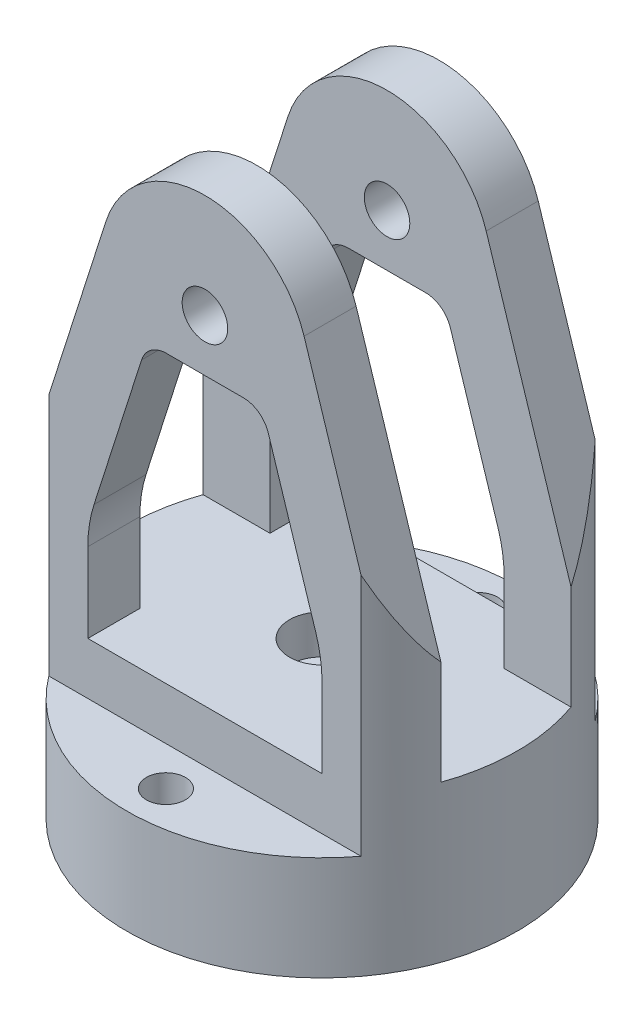
ISO-10303-21;
HEADER;
FILE_DESCRIPTION(('STEP AP214'),'2;1');
FILE_NAME('part.step','',(''),(''),'','','');
FILE_SCHEMA(('AUTOMOTIVE_DESIGN { 1 0 10303 214 1 1 1 1 }'));
ENDSEC;
DATA;
#1=APPLICATION_CONTEXT('core data for automotive mechanical design processes');
#2=APPLICATION_PROTOCOL_DEFINITION('international standard','automotive_design',2000,#1);
#3=PRODUCT_CONTEXT('',#1,'mechanical');
#4=PRODUCT('Part','Part','',(#3));
#5=PRODUCT_RELATED_PRODUCT_CATEGORY('part','',(#4));
#6=PRODUCT_DEFINITION_FORMATION('','',#4);
#7=PRODUCT_DEFINITION_CONTEXT('part definition',#1,'design');
#8=PRODUCT_DEFINITION('design','',#6,#7);
#9=PRODUCT_DEFINITION_SHAPE('','',#8);
#10=(LENGTH_UNIT() NAMED_UNIT(*) SI_UNIT(.MILLI.,.METRE.));
#11=(NAMED_UNIT(*) PLANE_ANGLE_UNIT() SI_UNIT($,.RADIAN.));
#12=(NAMED_UNIT(*) SI_UNIT($,.STERADIAN.) SOLID_ANGLE_UNIT());
#13=UNCERTAINTY_MEASURE_WITH_UNIT(LENGTH_MEASURE(1.E-05),#10,'distance_accuracy_value','');
#14=(GEOMETRIC_REPRESENTATION_CONTEXT(3) GLOBAL_UNCERTAINTY_ASSIGNED_CONTEXT((#13)) GLOBAL_UNIT_ASSIGNED_CONTEXT((#10,
#11,#12)) REPRESENTATION_CONTEXT('',''));
#15=CARTESIAN_POINT('',(0.,0.,0.));
#16=DIRECTION('',(0.,0.,1.));
#17=DIRECTION('',(1.,0.,0.));
#18=AXIS2_PLACEMENT_3D('',#15,#16,#17);
#19=CARTESIAN_POINT('',(0.,-100.402315710346,15.875));
#20=DIRECTION('',(0.,0.,1.));
#21=DIRECTION('',(1.,0.,0.));
#22=AXIS2_PLACEMENT_3D('',#19,#20,#21);
#23=PLANE('',#22);
#24=CARTESIAN_POINT('',(0.,120.65,15.875));
#25=DIRECTION('',(0.,0.,1.));
#26=DIRECTION('',(1.,0.,0.));
#27=AXIS2_PLACEMENT_3D('',#24,#25,#26);
#28=CIRCLE('',#27,5.55625);
#29=CARTESIAN_POINT('',(5.55625,120.65,15.875));
#30=VERTEX_POINT('',#29);
#31=EDGE_CURVE('E710',#30,#30,#28,.T.);
#32=ORIENTED_EDGE('',*,*,#31,.T.);
#33=EDGE_LOOP('',(#32));
#34=FACE_BOUND('',#33,.T.);
#35=DIRECTION('',(0.30403629343905,0.952660449620873,0.));
#36=VECTOR('',#35,1.);
#37=CARTESIAN_POINT('',(-88.2239091120022,-72.2461449258955,15.875));
#38=LINE('',#37,#36);
#39=CARTESIAN_POINT('',(-44.9012806053458,63.5,15.875));
#40=VERTEX_POINT('',#39);
#41=CARTESIAN_POINT('',(-24.1975754203702,128.372521853352,15.875));
#42=VERTEX_POINT('',#41);
#43=EDGE_CURVE('E717',#40,#42,#38,.T.);
#44=ORIENTED_EDGE('',*,*,#43,.T.);
#45=CARTESIAN_POINT('',(0.,120.65,15.875));
#46=DIRECTION('',(0.,0.,1.));
#47=DIRECTION('',(1.,0.,0.));
#48=AXIS2_PLACEMENT_3D('',#45,#46,#47);
#49=CIRCLE('',#48,25.4);
#50=CARTESIAN_POINT('',(24.1975754203702,128.372521853352,15.875));
#51=VERTEX_POINT('',#50);
#52=EDGE_CURVE('E708',#51,#42,#49,.T.);
#53=ORIENTED_EDGE('',*,*,#52,.F.);
#54=DIRECTION('',(-0.30403629343905,0.952660449620873,0.));
#55=VECTOR('',#54,1.);
#56=CARTESIAN_POINT('',(88.2239091120022,-72.2461449258955,15.875));
#57=LINE('',#56,#55);
#58=CARTESIAN_POINT('',(44.9012806053458,63.5,15.875));
#59=VERTEX_POINT('',#58);
#60=EDGE_CURVE('E725',#59,#51,#57,.T.);
#61=ORIENTED_EDGE('',*,*,#60,.F.);
#62=DIRECTION('',(0.,1.,0.));
#63=VECTOR('',#62,1.);
#64=CARTESIAN_POINT('',(44.9012806053458,-100.402315710346,15.875));
#65=LINE('',#64,#63);
#66=CARTESIAN_POINT('',(44.9012806053458,38.1,15.875));
#67=VERTEX_POINT('',#66);
#68=EDGE_CURVE('E632',#67,#59,#65,.T.);
#69=ORIENTED_EDGE('',*,*,#68,.F.);
#70=DIRECTION('',(1.,0.,0.));
#71=VECTOR('',#70,1.);
#72=CARTESIAN_POINT('',(0.,38.1,15.875));
#73=LINE('',#72,#71);
#74=CARTESIAN_POINT('',(28.575,38.1,15.875));
#75=VERTEX_POINT('',#74);
#76=EDGE_CURVE('E851',#75,#67,#73,.T.);
#77=ORIENTED_EDGE('',*,*,#76,.F.);
#78=DIRECTION('',(0.,1.,0.));
#79=VECTOR('',#78,1.);
#80=CARTESIAN_POINT('',(28.575,-100.402315710346,15.875));
#81=LINE('',#80,#79);
#82=CARTESIAN_POINT('',(28.575,57.4986477213851,15.875));
#83=VERTEX_POINT('',#82);
#84=EDGE_CURVE('E780',#75,#83,#81,.T.);
#85=ORIENTED_EDGE('',*,*,#84,.T.);
#86=CARTESIAN_POINT('',(-3.17499999999999,57.4986477213852,15.875));
#87=DIRECTION('',(0.,0.,1.));
#88=DIRECTION('',(1.,0.,0.));
#89=AXIS2_PLACEMENT_3D('',#86,#87,#88);
#90=CIRCLE('',#89,31.75);
#91=CARTESIAN_POINT('',(27.0719692754627,67.1518000380751,15.875));
#92=VERTEX_POINT('',#91);
#93=EDGE_CURVE('E788',#92,#83,#90,.F.);
#94=ORIENTED_EDGE('',*,*,#93,.F.);
#95=DIRECTION('',(-0.30403629343905,0.952660449620873,0.));
#96=VECTOR('',#95,1.);
#97=CARTESIAN_POINT('',(73.1004244742708,-77.0727210842404,15.875));
#98=LINE('',#97,#96);
#99=CARTESIAN_POINT('',(15.4618675161776,103.530630463338,15.875));
#100=VERTEX_POINT('',#99);
#101=EDGE_CURVE('E797',#92,#100,#98,.T.);
#102=ORIENTED_EDGE('',*,*,#101,.T.);
#103=CARTESIAN_POINT('',(9.41247366108504,101.6,15.875));
#104=DIRECTION('',(0.,0.,1.));
#105=DIRECTION('',(1.,0.,0.));
#106=AXIS2_PLACEMENT_3D('',#103,#104,#105);
#107=CIRCLE('',#106,6.35);
#108=CARTESIAN_POINT('',(9.41247366108501,107.95,15.875));
#109=VERTEX_POINT('',#108);
#110=EDGE_CURVE('E805',#100,#109,#107,.T.);
#111=ORIENTED_EDGE('',*,*,#110,.T.);
#112=DIRECTION('',(1.,0.,0.));
#113=VECTOR('',#112,1.);
#114=CARTESIAN_POINT('',(3.07195465380101E-13,107.95,15.875));
#115=LINE('',#114,#113);
#116=CARTESIAN_POINT('',(-9.41247366108502,107.95,15.875));
#117=VERTEX_POINT('',#116);
#118=EDGE_CURVE('E813',#117,#109,#115,.T.);
#119=ORIENTED_EDGE('',*,*,#118,.F.);
#120=CARTESIAN_POINT('',(-9.41247366108505,101.6,15.875));
#121=DIRECTION('',(0.,0.,1.));
#122=DIRECTION('',(1.,0.,0.));
#123=AXIS2_PLACEMENT_3D('',#120,#121,#122);
#124=CIRCLE('',#123,6.35);
#125=CARTESIAN_POINT('',(-15.4618675161776,103.530630463338,15.875));
#126=VERTEX_POINT('',#125);
#127=EDGE_CURVE('E820',#126,#117,#124,.F.);
#128=ORIENTED_EDGE('',*,*,#127,.F.);
#129=DIRECTION('',(0.30403629343905,0.952660449620873,0.));
#130=VECTOR('',#129,1.);
#131=CARTESIAN_POINT('',(-73.1004244742709,-77.0727210842404,15.875));
#132=LINE('',#131,#130);
#133=CARTESIAN_POINT('',(-27.0719692754627,67.1518000380752,15.875));
#134=VERTEX_POINT('',#133);
#135=EDGE_CURVE('E827',#134,#126,#132,.T.);
#136=ORIENTED_EDGE('',*,*,#135,.F.);
#137=CARTESIAN_POINT('',(3.17499999999999,57.4986477213852,15.875));
#138=DIRECTION('',(0.,0.,1.));
#139=DIRECTION('',(1.,0.,0.));
#140=AXIS2_PLACEMENT_3D('',#137,#138,#139);
#141=CIRCLE('',#140,31.75);
#142=CARTESIAN_POINT('',(-28.575,57.4986477213851,15.875));
#143=VERTEX_POINT('',#142);
#144=EDGE_CURVE('E834',#134,#143,#141,.T.);
#145=ORIENTED_EDGE('',*,*,#144,.T.);
#146=DIRECTION('',(0.,1.,0.));
#147=VECTOR('',#146,1.);
#148=CARTESIAN_POINT('',(-28.575,-100.402315710346,15.875));
#149=LINE('',#148,#147);
#150=CARTESIAN_POINT('',(-28.575,38.1,15.875));
#151=VERTEX_POINT('',#150);
#152=EDGE_CURVE('E842',#151,#143,#149,.T.);
#153=ORIENTED_EDGE('',*,*,#152,.F.);
#154=CARTESIAN_POINT('',(-44.9012806053458,38.1,15.875));
#155=VERTEX_POINT('',#154);
#156=EDGE_CURVE('E635',#155,#151,#73,.T.);
#157=ORIENTED_EDGE('',*,*,#156,.F.);
#158=DIRECTION('',(0.,1.,0.));
#159=VECTOR('',#158,1.);
#160=CARTESIAN_POINT('',(-44.9012806053458,-100.402315710346,15.875));
#161=LINE('',#160,#159);
#162=EDGE_CURVE('E624',#155,#40,#161,.T.);
#163=ORIENTED_EDGE('',*,*,#162,.T.);
#164=EDGE_LOOP('',(#44,#53,#61,#69,#77,#85,#94,#102,#111,#119,#128,#136,#145,#153,#157,#163));
#165=FACE_BOUND('',#164,.T.);
#166=ADVANCED_FACE('F383',(#34,#165),#23,.F.);
#167=CARTESIAN_POINT('',(0.,-100.402315710346,-15.875));
#168=DIRECTION('',(0.,0.,1.));
#169=DIRECTION('',(1.,0.,0.));
#170=AXIS2_PLACEMENT_3D('',#167,#168,#169);
#171=PLANE('',#170);
#172=CARTESIAN_POINT('',(0.,120.65,-15.875));
#173=DIRECTION('',(0.,0.,1.));
#174=DIRECTION('',(1.,0.,0.));
#175=AXIS2_PLACEMENT_3D('',#172,#173,#174);
#176=CIRCLE('',#175,5.55625);
#177=CARTESIAN_POINT('',(5.55625,120.65,-15.875));
#178=VERTEX_POINT('',#177);
#179=EDGE_CURVE('E713',#178,#178,#176,.T.);
#180=ORIENTED_EDGE('',*,*,#179,.F.);
#181=EDGE_LOOP('',(#180));
#182=FACE_BOUND('',#181,.T.);
#183=CARTESIAN_POINT('',(0.,120.65,-15.875));
#184=DIRECTION('',(0.,0.,1.));
#185=DIRECTION('',(1.,0.,0.));
#186=AXIS2_PLACEMENT_3D('',#183,#184,#185);
#187=CIRCLE('',#186,25.4);
#188=CARTESIAN_POINT('',(24.1975754203702,128.372521853352,-15.875));
#189=VERTEX_POINT('',#188);
#190=CARTESIAN_POINT('',(-24.1975754203702,128.372521853352,-15.875));
#191=VERTEX_POINT('',#190);
#192=EDGE_CURVE('E613',#189,#191,#187,.T.);
#193=ORIENTED_EDGE('',*,*,#192,.T.);
#194=DIRECTION('',(0.30403629343905,0.952660449620873,0.));
#195=VECTOR('',#194,1.);
#196=CARTESIAN_POINT('',(-88.2239091120022,-72.2461449258955,-15.875));
#197=LINE('',#196,#195);
#198=CARTESIAN_POINT('',(-44.9012806053458,63.5,-15.875));
#199=VERTEX_POINT('',#198);
#200=EDGE_CURVE('E597',#199,#191,#197,.T.);
#201=ORIENTED_EDGE('',*,*,#200,.F.);
#202=DIRECTION('',(0.,1.,0.));
#203=VECTOR('',#202,1.);
#204=CARTESIAN_POINT('',(-44.9012806053458,-100.402315710346,-15.875));
#205=LINE('',#204,#203);
#206=CARTESIAN_POINT('',(-44.9012806053458,38.1,-15.875));
#207=VERTEX_POINT('',#206);
#208=EDGE_CURVE('E610',#207,#199,#205,.T.);
#209=ORIENTED_EDGE('',*,*,#208,.F.);
#210=DIRECTION('',(1.,0.,0.));
#211=VECTOR('',#210,1.);
#212=CARTESIAN_POINT('',(0.,38.1,-15.875));
#213=LINE('',#212,#211);
#214=CARTESIAN_POINT('',(-28.575,38.1,-15.875));
#215=VERTEX_POINT('',#214);
#216=EDGE_CURVE('E852',#207,#215,#213,.T.);
#217=ORIENTED_EDGE('',*,*,#216,.T.);
#218=DIRECTION('',(0.,1.,0.));
#219=VECTOR('',#218,1.);
#220=CARTESIAN_POINT('',(-28.575,-100.402315710346,-15.875));
#221=LINE('',#220,#219);
#222=CARTESIAN_POINT('',(-28.575,57.4986477213851,-15.875));
#223=VERTEX_POINT('',#222);
#224=EDGE_CURVE('E689',#215,#223,#221,.T.);
#225=ORIENTED_EDGE('',*,*,#224,.T.);
#226=CARTESIAN_POINT('',(3.17499999999999,57.4986477213852,-15.875));
#227=DIRECTION('',(0.,0.,1.));
#228=DIRECTION('',(1.,0.,0.));
#229=AXIS2_PLACEMENT_3D('',#226,#227,#228);
#230=CIRCLE('',#229,31.75);
#231=CARTESIAN_POINT('',(-27.0719692754627,67.1518000380752,-15.875));
#232=VERTEX_POINT('',#231);
#233=EDGE_CURVE('E687',#232,#223,#230,.T.);
#234=ORIENTED_EDGE('',*,*,#233,.F.);
#235=DIRECTION('',(0.30403629343905,0.952660449620873,0.));
#236=VECTOR('',#235,1.);
#237=CARTESIAN_POINT('',(-73.1004244742709,-77.0727210842404,-15.875));
#238=LINE('',#237,#236);
#239=CARTESIAN_POINT('',(-15.4618675161776,103.530630463338,-15.875));
#240=VERTEX_POINT('',#239);
#241=EDGE_CURVE('E684',#232,#240,#238,.T.);
#242=ORIENTED_EDGE('',*,*,#241,.T.);
#243=CARTESIAN_POINT('',(-9.41247366108505,101.6,-15.875));
#244=DIRECTION('',(0.,0.,1.));
#245=DIRECTION('',(1.,0.,0.));
#246=AXIS2_PLACEMENT_3D('',#243,#244,#245);
#247=CIRCLE('',#246,6.35);
#248=CARTESIAN_POINT('',(-9.41247366108502,107.95,-15.875));
#249=VERTEX_POINT('',#248);
#250=EDGE_CURVE('E681',#240,#249,#247,.F.);
#251=ORIENTED_EDGE('',*,*,#250,.T.);
#252=DIRECTION('',(1.,0.,0.));
#253=VECTOR('',#252,1.);
#254=CARTESIAN_POINT('',(3.07195465380101E-13,107.95,-15.875));
#255=LINE('',#254,#253);
#256=CARTESIAN_POINT('',(9.41247366108501,107.95,-15.875));
#257=VERTEX_POINT('',#256);
#258=EDGE_CURVE('E678',#249,#257,#255,.T.);
#259=ORIENTED_EDGE('',*,*,#258,.T.);
#260=CARTESIAN_POINT('',(9.41247366108504,101.6,-15.875));
#261=DIRECTION('',(0.,0.,1.));
#262=DIRECTION('',(1.,0.,0.));
#263=AXIS2_PLACEMENT_3D('',#260,#261,#262);
#264=CIRCLE('',#263,6.35);
#265=CARTESIAN_POINT('',(15.4618675161776,103.530630463338,-15.875));
#266=VERTEX_POINT('',#265);
#267=EDGE_CURVE('E676',#266,#257,#264,.T.);
#268=ORIENTED_EDGE('',*,*,#267,.F.);
#269=DIRECTION('',(-0.30403629343905,0.952660449620873,0.));
#270=VECTOR('',#269,1.);
#271=CARTESIAN_POINT('',(73.1004244742708,-77.0727210842404,-15.875));
#272=LINE('',#271,#270);
#273=CARTESIAN_POINT('',(27.0719692754627,67.1518000380751,-15.875));
#274=VERTEX_POINT('',#273);
#275=EDGE_CURVE('E674',#274,#266,#272,.T.);
#276=ORIENTED_EDGE('',*,*,#275,.F.);
#277=CARTESIAN_POINT('',(-3.17499999999999,57.4986477213852,-15.875));
#278=DIRECTION('',(0.,0.,1.));
#279=DIRECTION('',(1.,0.,0.));
#280=AXIS2_PLACEMENT_3D('',#277,#278,#279);
#281=CIRCLE('',#280,31.75);
#282=CARTESIAN_POINT('',(28.575,57.4986477213851,-15.875));
#283=VERTEX_POINT('',#282);
#284=EDGE_CURVE('E671',#274,#283,#281,.F.);
#285=ORIENTED_EDGE('',*,*,#284,.T.);
#286=DIRECTION('',(0.,1.,0.));
#287=VECTOR('',#286,1.);
#288=CARTESIAN_POINT('',(28.575,-100.402315710346,-15.875));
#289=LINE('',#288,#287);
#290=CARTESIAN_POINT('',(28.575,38.1,-15.875));
#291=VERTEX_POINT('',#290);
#292=EDGE_CURVE('E669',#291,#283,#289,.T.);
#293=ORIENTED_EDGE('',*,*,#292,.F.);
#294=CARTESIAN_POINT('',(44.9012806053458,38.1,-15.875));
#295=VERTEX_POINT('',#294);
#296=EDGE_CURVE('E849',#291,#295,#213,.T.);
#297=ORIENTED_EDGE('',*,*,#296,.T.);
#298=DIRECTION('',(0.,1.,0.));
#299=VECTOR('',#298,1.);
#300=CARTESIAN_POINT('',(44.9012806053458,-100.402315710346,-15.875));
#301=LINE('',#300,#299);
#302=CARTESIAN_POINT('',(44.9012806053458,63.5,-15.875));
#303=VERTEX_POINT('',#302);
#304=EDGE_CURVE('E622',#295,#303,#301,.T.);
#305=ORIENTED_EDGE('',*,*,#304,.T.);
#306=DIRECTION('',(-0.30403629343905,0.952660449620873,0.));
#307=VECTOR('',#306,1.);
#308=CARTESIAN_POINT('',(88.2239091120022,-72.2461449258955,-15.875));
#309=LINE('',#308,#307);
#310=EDGE_CURVE('E729',#303,#189,#309,.T.);
#311=ORIENTED_EDGE('',*,*,#310,.T.);
#312=EDGE_LOOP('',(#193,#201,#209,#217,#225,#234,#242,#251,#259,#268,#276,#285,#293,#297,#305,#311));
#313=FACE_BOUND('',#312,.T.);
#314=ADVANCED_FACE('F608',(#182,#313),#171,.T.);
#315=CARTESIAN_POINT('',(0.,-78.5451621680164,-28.575));
#316=DIRECTION('',(0.,0.,1.));
#317=DIRECTION('',(1.,0.,0.));
#318=AXIS2_PLACEMENT_3D('',#315,#316,#317);
#319=PLANE('',#318);
#320=CARTESIAN_POINT('',(0.,120.65,-28.575));
#321=DIRECTION('',(0.,0.,1.));
#322=DIRECTION('',(1.,0.,0.));
#323=AXIS2_PLACEMENT_3D('',#320,#321,#322);
#324=CIRCLE('',#323,5.55625);
#325=CARTESIAN_POINT('',(5.55625,120.65,-28.575));
#326=VERTEX_POINT('',#325);
#327=EDGE_CURVE('E942',#326,#326,#324,.T.);
#328=ORIENTED_EDGE('',*,*,#327,.T.);
#329=EDGE_LOOP('',(#328));
#330=FACE_BOUND('',#329,.T.);
#331=DIRECTION('',(0.,1.,0.));
#332=VECTOR('',#331,1.);
#333=CARTESIAN_POINT('',(-28.575,-78.5451621680164,-28.575));
#334=LINE('',#333,#332);
#335=CARTESIAN_POINT('',(-28.575,38.1,-28.575));
#336=VERTEX_POINT('',#335);
#337=CARTESIAN_POINT('',(-28.575,57.4986477213851,-28.575));
#338=VERTEX_POINT('',#337);
#339=EDGE_CURVE('E847',#336,#338,#334,.T.);
#340=ORIENTED_EDGE('',*,*,#339,.F.);
#341=DIRECTION('',(1.,0.,0.));
#342=VECTOR('',#341,1.);
#343=CARTESIAN_POINT('',(0.,38.1,-28.575));
#344=LINE('',#343,#342);
#345=CARTESIAN_POINT('',(28.575,38.1,-28.575));
#346=VERTEX_POINT('',#345);
#347=EDGE_CURVE('E777',#336,#346,#344,.T.);
#348=ORIENTED_EDGE('',*,*,#347,.T.);
#349=DIRECTION('',(0.,1.,0.));
#350=VECTOR('',#349,1.);
#351=CARTESIAN_POINT('',(28.575,-78.5451621680164,-28.575));
#352=LINE('',#351,#350);
#353=CARTESIAN_POINT('',(28.575,57.4986477213851,-28.575));
#354=VERTEX_POINT('',#353);
#355=EDGE_CURVE('E785',#346,#354,#352,.T.);
#356=ORIENTED_EDGE('',*,*,#355,.T.);
#357=CARTESIAN_POINT('',(-3.17499999999999,57.4986477213852,-28.575));
#358=DIRECTION('',(0.,0.,1.));
#359=DIRECTION('',(1.,0.,0.));
#360=AXIS2_PLACEMENT_3D('',#357,#358,#359);
#361=CIRCLE('',#360,31.75);
#362=CARTESIAN_POINT('',(27.0719692754627,67.1518000380751,-28.575));
#363=VERTEX_POINT('',#362);
#364=EDGE_CURVE('E794',#363,#354,#361,.F.);
#365=ORIENTED_EDGE('',*,*,#364,.F.);
#366=DIRECTION('',(-0.30403629343905,0.952660449620873,0.));
#367=VECTOR('',#366,1.);
#368=CARTESIAN_POINT('',(66.7696452569015,-57.2360005814013,-28.575));
#369=LINE('',#368,#367);
#370=CARTESIAN_POINT('',(15.4618675161776,103.530630463338,-28.575));
#371=VERTEX_POINT('',#370);
#372=EDGE_CURVE('E802',#363,#371,#369,.T.);
#373=ORIENTED_EDGE('',*,*,#372,.T.);
#374=CARTESIAN_POINT('',(9.41247366108504,101.6,-28.575));
#375=DIRECTION('',(0.,0.,1.));
#376=DIRECTION('',(1.,0.,0.));
#377=AXIS2_PLACEMENT_3D('',#374,#375,#376);
#378=CIRCLE('',#377,6.35);
#379=CARTESIAN_POINT('',(9.41247366108501,107.95,-28.575));
#380=VERTEX_POINT('',#379);
#381=EDGE_CURVE('E810',#371,#380,#378,.T.);
#382=ORIENTED_EDGE('',*,*,#381,.T.);
#383=DIRECTION('',(1.,0.,0.));
#384=VECTOR('',#383,1.);
#385=CARTESIAN_POINT('',(2.74969193109363E-13,107.95,-28.575));
#386=LINE('',#385,#384);
#387=CARTESIAN_POINT('',(-9.41247366108502,107.95,-28.575));
#388=VERTEX_POINT('',#387);
#389=EDGE_CURVE('E818',#388,#380,#386,.T.);
#390=ORIENTED_EDGE('',*,*,#389,.F.);
#391=CARTESIAN_POINT('',(-9.41247366108505,101.6,-28.575));
#392=DIRECTION('',(0.,0.,1.));
#393=DIRECTION('',(1.,0.,0.));
#394=AXIS2_PLACEMENT_3D('',#391,#392,#393);
#395=CIRCLE('',#394,6.35);
#396=CARTESIAN_POINT('',(-15.4618675161776,103.530630463338,-28.575));
#397=VERTEX_POINT('',#396);
#398=EDGE_CURVE('E825',#397,#388,#395,.F.);
#399=ORIENTED_EDGE('',*,*,#398,.F.);
#400=DIRECTION('',(0.30403629343905,0.952660449620873,0.));
#401=VECTOR('',#400,1.);
#402=CARTESIAN_POINT('',(-66.7696452569015,-57.2360005814013,-28.575));
#403=LINE('',#402,#401);
#404=CARTESIAN_POINT('',(-27.0719692754627,67.1518000380752,-28.575));
#405=VERTEX_POINT('',#404);
#406=EDGE_CURVE('E832',#405,#397,#403,.T.);
#407=ORIENTED_EDGE('',*,*,#406,.F.);
#408=CARTESIAN_POINT('',(3.17499999999999,57.4986477213852,-28.575));
#409=DIRECTION('',(0.,0.,1.));
#410=DIRECTION('',(1.,0.,0.));
#411=AXIS2_PLACEMENT_3D('',#408,#409,#410);
#412=CIRCLE('',#411,31.75);
#413=EDGE_CURVE('E839',#405,#338,#412,.T.);
#414=ORIENTED_EDGE('',*,*,#413,.T.);
#415=EDGE_LOOP('',(#340,#348,#356,#365,#373,#382,#390,#399,#407,#414));
#416=FACE_BOUND('',#415,.T.);
#417=DIRECTION('',(0.30403629343905,0.952660449620873,0.));
#418=VECTOR('',#417,1.);
#419=CARTESIAN_POINT('',(-81.8931298946328,-52.4094244230565,-28.575));
#420=LINE('',#419,#418);
#421=CARTESIAN_POINT('',(-38.1,84.8109789170132,-28.575));
#422=VERTEX_POINT('',#421);
#423=CARTESIAN_POINT('',(-24.1975754203702,128.372521853352,-28.575));
#424=VERTEX_POINT('',#423);
#425=EDGE_CURVE('E600',#422,#424,#420,.T.);
#426=ORIENTED_EDGE('',*,*,#425,.T.);
#427=CARTESIAN_POINT('',(0.,120.65,-28.575));
#428=DIRECTION('',(0.,0.,1.));
#429=DIRECTION('',(1.,0.,0.));
#430=AXIS2_PLACEMENT_3D('',#427,#428,#429);
#431=CIRCLE('',#430,25.4);
#432=CARTESIAN_POINT('',(24.1975754203702,128.372521853352,-28.575));
#433=VERTEX_POINT('',#432);
#434=EDGE_CURVE('E731',#433,#424,#431,.T.);
#435=ORIENTED_EDGE('',*,*,#434,.F.);
#436=DIRECTION('',(-0.30403629343905,0.952660449620873,0.));
#437=VECTOR('',#436,1.);
#438=CARTESIAN_POINT('',(81.8931298946328,-52.4094244230565,-28.575));
#439=LINE('',#438,#437);
#440=CARTESIAN_POINT('',(38.1,84.8109789170131,-28.575));
#441=VERTEX_POINT('',#440);
#442=EDGE_CURVE('E727',#441,#433,#439,.T.);
#443=ORIENTED_EDGE('',*,*,#442,.F.);
#444=DIRECTION('',(0.,1.,0.));
#445=VECTOR('',#444,1.);
#446=CARTESIAN_POINT('',(38.1,-78.5451621680164,-28.575));
#447=LINE('',#446,#445);
#448=CARTESIAN_POINT('',(38.1,25.4,-28.575));
#449=VERTEX_POINT('',#448);
#450=EDGE_CURVE('E655',#449,#441,#447,.T.);
#451=ORIENTED_EDGE('',*,*,#450,.F.);
#452=DIRECTION('',(1.,0.,0.));
#453=VECTOR('',#452,1.);
#454=CARTESIAN_POINT('',(0.,25.4,-28.575));
#455=LINE('',#454,#453);
#456=CARTESIAN_POINT('',(-38.1,25.4,-28.575));
#457=VERTEX_POINT('',#456);
#458=EDGE_CURVE('E652',#457,#449,#455,.T.);
#459=ORIENTED_EDGE('',*,*,#458,.F.);
#460=DIRECTION('',(0.,1.,0.));
#461=VECTOR('',#460,1.);
#462=CARTESIAN_POINT('',(-38.1,-78.5451621680164,-28.575));
#463=LINE('',#462,#461);
#464=EDGE_CURVE('E659',#457,#422,#463,.T.);
#465=ORIENTED_EDGE('',*,*,#464,.T.);
#466=EDGE_LOOP('',(#426,#435,#443,#451,#459,#465));
#467=FACE_BOUND('',#466,.T.);
#468=ADVANCED_FACE('F867',(#330,#416,#467),#319,.F.);
#469=CARTESIAN_POINT('',(0.,-78.5451621680164,28.575));
#470=DIRECTION('',(0.,0.,1.));
#471=DIRECTION('',(1.,0.,0.));
#472=AXIS2_PLACEMENT_3D('',#469,#470,#471);
#473=PLANE('',#472);
#474=CARTESIAN_POINT('',(0.,120.65,28.575));
#475=DIRECTION('',(0.,0.,1.));
#476=DIRECTION('',(1.,0.,0.));
#477=AXIS2_PLACEMENT_3D('',#474,#475,#476);
#478=CIRCLE('',#477,5.55625);
#479=CARTESIAN_POINT('',(5.55625,120.65,28.575));
#480=VERTEX_POINT('',#479);
#481=EDGE_CURVE('E387',#480,#480,#478,.T.);
#482=ORIENTED_EDGE('',*,*,#481,.F.);
#483=EDGE_LOOP('',(#482));
#484=FACE_BOUND('',#483,.T.);
#485=DIRECTION('',(1.,0.,0.));
#486=VECTOR('',#485,1.);
#487=CARTESIAN_POINT('',(0.,38.1,28.575));
#488=LINE('',#487,#486);
#489=CARTESIAN_POINT('',(-28.575,38.1,28.575));
#490=VERTEX_POINT('',#489);
#491=CARTESIAN_POINT('',(28.575,38.1,28.575));
#492=VERTEX_POINT('',#491);
#493=EDGE_CURVE('E774',#490,#492,#488,.T.);
#494=ORIENTED_EDGE('',*,*,#493,.F.);
#495=DIRECTION('',(0.,1.,0.));
#496=VECTOR('',#495,1.);
#497=CARTESIAN_POINT('',(-28.575,-78.5451621680164,28.575));
#498=LINE('',#497,#496);
#499=CARTESIAN_POINT('',(-28.575,57.4986477213851,28.575));
#500=VERTEX_POINT('',#499);
#501=EDGE_CURVE('E844',#490,#500,#498,.T.);
#502=ORIENTED_EDGE('',*,*,#501,.T.);
#503=CARTESIAN_POINT('',(3.17499999999999,57.4986477213852,28.575));
#504=DIRECTION('',(0.,0.,1.));
#505=DIRECTION('',(1.,0.,0.));
#506=AXIS2_PLACEMENT_3D('',#503,#504,#505);
#507=CIRCLE('',#506,31.75);
#508=CARTESIAN_POINT('',(-27.0719692754627,67.1518000380752,28.575));
#509=VERTEX_POINT('',#508);
#510=EDGE_CURVE('E837',#509,#500,#507,.T.);
#511=ORIENTED_EDGE('',*,*,#510,.F.);
#512=DIRECTION('',(0.30403629343905,0.952660449620873,0.));
#513=VECTOR('',#512,1.);
#514=CARTESIAN_POINT('',(-66.7696452569015,-57.2360005814013,28.575));
#515=LINE('',#514,#513);
#516=CARTESIAN_POINT('',(-15.4618675161776,103.530630463338,28.575));
#517=VERTEX_POINT('',#516);
#518=EDGE_CURVE('E829',#509,#517,#515,.T.);
#519=ORIENTED_EDGE('',*,*,#518,.T.);
#520=CARTESIAN_POINT('',(-9.41247366108505,101.6,28.575));
#521=DIRECTION('',(0.,0.,1.));
#522=DIRECTION('',(1.,0.,0.));
#523=AXIS2_PLACEMENT_3D('',#520,#521,#522);
#524=CIRCLE('',#523,6.35);
#525=CARTESIAN_POINT('',(-9.41247366108502,107.95,28.575));
#526=VERTEX_POINT('',#525);
#527=EDGE_CURVE('E822',#517,#526,#524,.F.);
#528=ORIENTED_EDGE('',*,*,#527,.T.);
#529=DIRECTION('',(1.,0.,0.));
#530=VECTOR('',#529,1.);
#531=CARTESIAN_POINT('',(2.74969193109363E-13,107.95,28.575));
#532=LINE('',#531,#530);
#533=CARTESIAN_POINT('',(9.41247366108501,107.95,28.575));
#534=VERTEX_POINT('',#533);
#535=EDGE_CURVE('E815',#526,#534,#532,.T.);
#536=ORIENTED_EDGE('',*,*,#535,.T.);
#537=CARTESIAN_POINT('',(9.41247366108504,101.6,28.575));
#538=DIRECTION('',(0.,0.,1.));
#539=DIRECTION('',(1.,0.,0.));
#540=AXIS2_PLACEMENT_3D('',#537,#538,#539);
#541=CIRCLE('',#540,6.35);
#542=CARTESIAN_POINT('',(15.4618675161776,103.530630463338,28.575));
#543=VERTEX_POINT('',#542);
#544=EDGE_CURVE('E808',#543,#534,#541,.T.);
#545=ORIENTED_EDGE('',*,*,#544,.F.);
#546=DIRECTION('',(-0.30403629343905,0.952660449620873,0.));
#547=VECTOR('',#546,1.);
#548=CARTESIAN_POINT('',(66.7696452569015,-57.2360005814013,28.575));
#549=LINE('',#548,#547);
#550=CARTESIAN_POINT('',(27.0719692754627,67.1518000380751,28.575));
#551=VERTEX_POINT('',#550);
#552=EDGE_CURVE('E800',#551,#543,#549,.T.);
#553=ORIENTED_EDGE('',*,*,#552,.F.);
#554=CARTESIAN_POINT('',(-3.17499999999999,57.4986477213852,28.575));
#555=DIRECTION('',(0.,0.,1.));
#556=DIRECTION('',(1.,0.,0.));
#557=AXIS2_PLACEMENT_3D('',#554,#555,#556);
#558=CIRCLE('',#557,31.75);
#559=CARTESIAN_POINT('',(28.575,57.4986477213851,28.575));
#560=VERTEX_POINT('',#559);
#561=EDGE_CURVE('E791',#551,#560,#558,.F.);
#562=ORIENTED_EDGE('',*,*,#561,.T.);
#563=DIRECTION('',(0.,1.,0.));
#564=VECTOR('',#563,1.);
#565=CARTESIAN_POINT('',(28.575,-78.5451621680164,28.575));
#566=LINE('',#565,#564);
#567=EDGE_CURVE('E783',#492,#560,#566,.T.);
#568=ORIENTED_EDGE('',*,*,#567,.F.);
#569=EDGE_LOOP('',(#494,#502,#511,#519,#528,#536,#545,#553,#562,#568));
#570=FACE_BOUND('',#569,.T.);
#571=CARTESIAN_POINT('',(0.,120.65,28.575));
#572=DIRECTION('',(0.,0.,1.));
#573=DIRECTION('',(1.,0.,0.));
#574=AXIS2_PLACEMENT_3D('',#571,#572,#573);
#575=CIRCLE('',#574,25.4);
#576=CARTESIAN_POINT('',(24.1975754203702,128.372521853352,28.575));
#577=VERTEX_POINT('',#576);
#578=CARTESIAN_POINT('',(-24.1975754203702,128.372521853352,28.575));
#579=VERTEX_POINT('',#578);
#580=EDGE_CURVE('E392',#577,#579,#575,.T.);
#581=ORIENTED_EDGE('',*,*,#580,.T.);
#582=DIRECTION('',(0.30403629343905,0.952660449620873,0.));
#583=VECTOR('',#582,1.);
#584=CARTESIAN_POINT('',(-81.8931298946328,-52.4094244230565,28.575));
#585=LINE('',#584,#583);
#586=CARTESIAN_POINT('',(-38.1,84.8109789170132,28.575));
#587=VERTEX_POINT('',#586);
#588=EDGE_CURVE('E13',#587,#579,#585,.T.);
#589=ORIENTED_EDGE('',*,*,#588,.F.);
#590=DIRECTION('',(0.,1.,0.));
#591=VECTOR('',#590,1.);
#592=CARTESIAN_POINT('',(-38.1,-78.5451621680164,28.575));
#593=LINE('',#592,#591);
#594=CARTESIAN_POINT('',(-38.1,25.4,28.575));
#595=VERTEX_POINT('',#594);
#596=EDGE_CURVE('E649',#595,#587,#593,.T.);
#597=ORIENTED_EDGE('',*,*,#596,.F.);
#598=DIRECTION('',(1.,0.,0.));
#599=VECTOR('',#598,1.);
#600=CARTESIAN_POINT('',(0.,25.4,28.575));
#601=LINE('',#600,#599);
#602=CARTESIAN_POINT('',(38.1,25.4,28.575));
#603=VERTEX_POINT('',#602);
#604=EDGE_CURVE('E641',#595,#603,#601,.T.);
#605=ORIENTED_EDGE('',*,*,#604,.T.);
#606=DIRECTION('',(0.,1.,0.));
#607=VECTOR('',#606,1.);
#608=CARTESIAN_POINT('',(38.1,-78.5451621680164,28.575));
#609=LINE('',#608,#607);
#610=CARTESIAN_POINT('',(38.1,84.8109789170132,28.575));
#611=VERTEX_POINT('',#610);
#612=EDGE_CURVE('E645',#603,#611,#609,.T.);
#613=ORIENTED_EDGE('',*,*,#612,.T.);
#614=DIRECTION('',(-0.30403629343905,0.952660449620873,0.));
#615=VECTOR('',#614,1.);
#616=CARTESIAN_POINT('',(81.8931298946328,-52.4094244230565,28.575));
#617=LINE('',#616,#615);
#618=EDGE_CURVE('E692',#611,#577,#617,.T.);
#619=ORIENTED_EDGE('',*,*,#618,.T.);
#620=EDGE_LOOP('',(#581,#589,#597,#605,#613,#619));
#621=FACE_BOUND('',#620,.T.);
#622=ADVANCED_FACE('F697',(#484,#570,#621),#473,.T.);
#623=CARTESIAN_POINT('',(0.,0.,0.));
#624=DIRECTION('',(0.,-1.,0.));
#625=DIRECTION('',(0.,0.,-1.));
#626=AXIS2_PLACEMENT_3D('',#623,#624,#625);
#627=CYLINDRICAL_SURFACE('',#626,47.625);
#628=CARTESIAN_POINT('',(0.,204.192657729091,0.));
#629=DIRECTION('',(0.952660449620873,-0.30403629343905,0.));
#630=DIRECTION('',(-0.30403629343905,-0.952660449620873,0.));
#631=AXIS2_PLACEMENT_3D('',#628,#629,#630);
#632=ELLIPSE('',#631,156.642483242046,47.625);
#633=EDGE_CURVE('E606',#40,#587,#632,.F.);
#634=ORIENTED_EDGE('',*,*,#633,.F.);
#635=ORIENTED_EDGE('',*,*,#162,.F.);
#636=CARTESIAN_POINT('',(0.,38.1,0.));
#637=DIRECTION('',(0.,-1.,0.));
#638=DIRECTION('',(0.,0.,-1.));
#639=AXIS2_PLACEMENT_3D('',#636,#637,#638);
#640=CIRCLE('',#639,47.625);
#641=EDGE_CURVE('E621',#207,#155,#640,.F.);
#642=ORIENTED_EDGE('',*,*,#641,.F.);
#643=ORIENTED_EDGE('',*,*,#208,.T.);
#644=EDGE_CURVE('E593',#422,#199,#632,.F.);
#645=ORIENTED_EDGE('',*,*,#644,.F.);
#646=ORIENTED_EDGE('',*,*,#464,.F.);
#647=CARTESIAN_POINT('',(0.,25.4,0.));
#648=DIRECTION('',(0.,-1.,0.));
#649=DIRECTION('',(0.,0.,-1.));
#650=AXIS2_PLACEMENT_3D('',#647,#648,#649);
#651=CIRCLE('',#650,47.625);
#652=EDGE_CURVE('E656',#449,#457,#651,.F.);
#653=ORIENTED_EDGE('',*,*,#652,.F.);
#654=ORIENTED_EDGE('',*,*,#450,.T.);
#655=CARTESIAN_POINT('',(0.,204.192657729091,0.));
#656=DIRECTION('',(0.952660449620873,0.30403629343905,0.));
#657=DIRECTION('',(0.30403629343905,-0.952660449620873,0.));
#658=AXIS2_PLACEMENT_3D('',#655,#656,#657);
#659=ELLIPSE('',#658,156.642483242046,47.625);
#660=EDGE_CURVE('E399',#441,#303,#659,.F.);
#661=ORIENTED_EDGE('',*,*,#660,.T.);
#662=ORIENTED_EDGE('',*,*,#304,.F.);
#663=CARTESIAN_POINT('',(0.,38.1,0.));
#664=DIRECTION('',(0.,-1.,0.));
#665=DIRECTION('',(0.,0.,-1.));
#666=AXIS2_PLACEMENT_3D('',#663,#664,#665);
#667=CIRCLE('',#666,47.625);
#668=EDGE_CURVE('E627',#67,#295,#667,.F.);
#669=ORIENTED_EDGE('',*,*,#668,.F.);
#670=ORIENTED_EDGE('',*,*,#68,.T.);
#671=EDGE_CURVE('E722',#59,#611,#659,.F.);
#672=ORIENTED_EDGE('',*,*,#671,.T.);
#673=ORIENTED_EDGE('',*,*,#612,.F.);
#674=CARTESIAN_POINT('',(0.,25.4,0.));
#675=DIRECTION('',(0.,-1.,0.));
#676=DIRECTION('',(0.,0.,-1.));
#677=AXIS2_PLACEMENT_3D('',#674,#675,#676);
#678=CIRCLE('',#677,47.625);
#679=EDGE_CURVE('E642',#595,#603,#678,.F.);
#680=ORIENTED_EDGE('',*,*,#679,.F.);
#681=ORIENTED_EDGE('',*,*,#596,.T.);
#682=EDGE_LOOP('',(#634,#635,#642,#643,#645,#646,#653,#654,#661,#662,#669,#670,#672,#673,#680,#681));
#683=FACE_BOUND('',#682,.T.);
#684=CARTESIAN_POINT('',(0.,0.,0.));
#685=DIRECTION('',(0.,-1.,0.));
#686=DIRECTION('',(0.,0.,-1.));
#687=AXIS2_PLACEMENT_3D('',#684,#685,#686);
#688=CIRCLE('',#687,47.625);
#689=CARTESIAN_POINT('',(0.,0.,-47.625));
#690=VERTEX_POINT('',#689);
#691=EDGE_CURVE('E666',#690,#690,#688,.T.);
#692=ORIENTED_EDGE('',*,*,#691,.F.);
#693=EDGE_LOOP('',(#692));
#694=FACE_BOUND('',#693,.T.);
#695=ADVANCED_FACE('F617',(#683,#694),#627,.T.);
#696=CARTESIAN_POINT('',(0.,0.,0.));
#697=DIRECTION('',(0.,-1.,0.));
#698=DIRECTION('',(0.,0.,-1.));
#699=AXIS2_PLACEMENT_3D('',#696,#697,#698);
#700=PLANE('',#699);
#701=CARTESIAN_POINT('',(0.,0.,-38.1));
#702=DIRECTION('',(0.,1.,0.));
#703=DIRECTION('',(0.,0.,-1.));
#704=AXIS2_PLACEMENT_3D('',#701,#702,#703);
#705=CIRCLE('',#704,4.7625);
#706=CARTESIAN_POINT('',(0.,0.,-42.8625));
#707=VERTEX_POINT('',#706);
#708=EDGE_CURVE('E932',#707,#707,#705,.T.);
#709=ORIENTED_EDGE('',*,*,#708,.T.);
#710=EDGE_LOOP('',(#709));
#711=FACE_BOUND('',#710,.T.);
#712=CARTESIAN_POINT('',(0.,0.,38.1));
#713=DIRECTION('',(0.,1.,0.));
#714=DIRECTION('',(0.,0.,1.));
#715=AXIS2_PLACEMENT_3D('',#712,#713,#714);
#716=CIRCLE('',#715,4.7625);
#717=CARTESIAN_POINT('',(0.,0.,42.8625));
#718=VERTEX_POINT('',#717);
#719=EDGE_CURVE('E936',#718,#718,#716,.T.);
#720=ORIENTED_EDGE('',*,*,#719,.T.);
#721=EDGE_LOOP('',(#720));
#722=FACE_BOUND('',#721,.T.);
#723=ORIENTED_EDGE('',*,*,#691,.T.);
#724=EDGE_LOOP('',(#723));
#725=FACE_BOUND('',#724,.T.);
#726=ADVANCED_FACE('F385',(#711,#722,#725),#700,.T.);
#727=CARTESIAN_POINT('',(0.,25.4,0.));
#728=DIRECTION('',(0.,-1.,0.));
#729=DIRECTION('',(0.,0.,-1.));
#730=AXIS2_PLACEMENT_3D('',#727,#728,#729);
#731=PLANE('',#730);
#732=CARTESIAN_POINT('',(0.,25.4,-38.1));
#733=DIRECTION('',(0.,1.,0.));
#734=DIRECTION('',(0.,0.,-1.));
#735=AXIS2_PLACEMENT_3D('',#732,#733,#734);
#736=CIRCLE('',#735,4.7625);
#737=CARTESIAN_POINT('',(0.,25.4,-42.8625));
#738=VERTEX_POINT('',#737);
#739=EDGE_CURVE('E946',#738,#738,#736,.T.);
#740=ORIENTED_EDGE('',*,*,#739,.F.);
#741=EDGE_LOOP('',(#740));
#742=FACE_BOUND('',#741,.T.);
#743=ORIENTED_EDGE('',*,*,#652,.T.);
#744=ORIENTED_EDGE('',*,*,#458,.T.);
#745=EDGE_LOOP('',(#743,#744));
#746=FACE_BOUND('',#745,.T.);
#747=ADVANCED_FACE('F870',(#742,#746),#731,.F.);
#748=CARTESIAN_POINT('',(0.,25.4,0.));
#749=DIRECTION('',(0.,-1.,0.));
#750=DIRECTION('',(0.,0.,-1.));
#751=AXIS2_PLACEMENT_3D('',#748,#749,#750);
#752=PLANE('',#751);
#753=CARTESIAN_POINT('',(0.,25.4,38.1));
#754=DIRECTION('',(0.,1.,0.));
#755=DIRECTION('',(0.,0.,1.));
#756=AXIS2_PLACEMENT_3D('',#753,#754,#755);
#757=CIRCLE('',#756,4.7625);
#758=CARTESIAN_POINT('',(0.,25.4,42.8625));
#759=VERTEX_POINT('',#758);
#760=EDGE_CURVE('E939',#759,#759,#757,.T.);
#761=ORIENTED_EDGE('',*,*,#760,.F.);
#762=EDGE_LOOP('',(#761));
#763=FACE_BOUND('',#762,.T.);
#764=ORIENTED_EDGE('',*,*,#679,.T.);
#765=ORIENTED_EDGE('',*,*,#604,.F.);
#766=EDGE_LOOP('',(#764,#765));
#767=FACE_BOUND('',#766,.T.);
#768=ADVANCED_FACE('F902',(#763,#767),#752,.F.);
#769=CARTESIAN_POINT('',(0.,38.1,0.));
#770=DIRECTION('',(0.,-1.,0.));
#771=DIRECTION('',(0.,0.,-1.));
#772=AXIS2_PLACEMENT_3D('',#769,#770,#771);
#773=PLANE('',#772);
#774=ORIENTED_EDGE('',*,*,#296,.F.);
#775=DIRECTION('',(0.,0.,1.));
#776=VECTOR('',#775,1.);
#777=CARTESIAN_POINT('',(28.575,38.1,-47.625));
#778=LINE('',#777,#776);
#779=EDGE_CURVE('E772',#346,#291,#778,.T.);
#780=ORIENTED_EDGE('',*,*,#779,.F.);
#781=ORIENTED_EDGE('',*,*,#347,.F.);
#782=DIRECTION('',(0.,0.,1.));
#783=VECTOR('',#782,1.);
#784=CARTESIAN_POINT('',(-28.575,38.1,-47.625));
#785=LINE('',#784,#783);
#786=EDGE_CURVE('E739',#336,#215,#785,.T.);
#787=ORIENTED_EDGE('',*,*,#786,.T.);
#788=ORIENTED_EDGE('',*,*,#216,.F.);
#789=ORIENTED_EDGE('',*,*,#641,.T.);
#790=ORIENTED_EDGE('',*,*,#156,.T.);
#791=EDGE_CURVE('E736',#151,#490,#785,.T.);
#792=ORIENTED_EDGE('',*,*,#791,.T.);
#793=ORIENTED_EDGE('',*,*,#493,.T.);
#794=EDGE_CURVE('E735',#75,#492,#778,.T.);
#795=ORIENTED_EDGE('',*,*,#794,.F.);
#796=ORIENTED_EDGE('',*,*,#76,.T.);
#797=ORIENTED_EDGE('',*,*,#668,.T.);
#798=EDGE_LOOP('',(#774,#780,#781,#787,#788,#789,#790,#792,#793,#795,#796,#797));
#799=FACE_BOUND('',#798,.T.);
#800=CARTESIAN_POINT('',(0.,38.1,0.));
#801=DIRECTION('',(0.,-1.,0.));
#802=DIRECTION('',(0.,0.,-1.));
#803=AXIS2_PLACEMENT_3D('',#800,#801,#802);
#804=CIRCLE('',#803,7.9375);
#805=CARTESIAN_POINT('',(0.,38.1,-7.9375));
#806=VERTEX_POINT('',#805);
#807=EDGE_CURVE('E638',#806,#806,#804,.T.);
#808=ORIENTED_EDGE('',*,*,#807,.T.);
#809=EDGE_LOOP('',(#808));
#810=FACE_BOUND('',#809,.T.);
#811=ADVANCED_FACE('F860',(#799,#810),#773,.F.);
#812=CARTESIAN_POINT('',(0.,0.,0.));
#813=DIRECTION('',(0.,-1.,0.));
#814=DIRECTION('',(0.,0.,-1.));
#815=AXIS2_PLACEMENT_3D('',#812,#813,#814);
#816=CYLINDRICAL_SURFACE('',#815,7.9375);
#817=CARTESIAN_POINT('',(0.,28.575,0.));
#818=DIRECTION('',(0.,-1.,0.));
#819=DIRECTION('',(0.,0.,-1.));
#820=AXIS2_PLACEMENT_3D('',#817,#818,#819);
#821=CIRCLE('',#820,7.9375);
#822=CARTESIAN_POINT('',(0.,28.575,-7.9375));
#823=VERTEX_POINT('',#822);
#824=EDGE_CURVE('E663',#823,#823,#821,.T.);
#825=ORIENTED_EDGE('',*,*,#824,.T.);
#826=EDGE_LOOP('',(#825));
#827=FACE_BOUND('',#826,.T.);
#828=ORIENTED_EDGE('',*,*,#807,.F.);
#829=EDGE_LOOP('',(#828));
#830=FACE_BOUND('',#829,.T.);
#831=ADVANCED_FACE('F901',(#827,#830),#816,.F.);
#832=CARTESIAN_POINT('',(0.,28.575,-7.9375));
#833=DIRECTION('',(0.,1.,0.));
#834=DIRECTION('',(0.,0.,1.));
#835=AXIS2_PLACEMENT_3D('',#832,#833,#834);
#836=PLANE('',#835);
#837=ORIENTED_EDGE('',*,*,#824,.F.);
#838=EDGE_LOOP('',(#837));
#839=FACE_BOUND('',#838,.T.);
#840=ADVANCED_FACE('F915',(#839),#836,.T.);
#841=CARTESIAN_POINT('',(28.575,0.,-47.625));
#842=DIRECTION('',(1.,0.,0.));
#843=DIRECTION('',(0.,0.,-1.));
#844=AXIS2_PLACEMENT_3D('',#841,#842,#843);
#845=PLANE('',#844);
#846=ORIENTED_EDGE('',*,*,#779,.T.);
#847=ORIENTED_EDGE('',*,*,#292,.T.);
#848=DIRECTION('',(0.,0.,1.));
#849=VECTOR('',#848,1.);
#850=CARTESIAN_POINT('',(28.575,57.4986477213851,-47.625));
#851=LINE('',#850,#849);
#852=EDGE_CURVE('E768',#354,#283,#851,.T.);
#853=ORIENTED_EDGE('',*,*,#852,.F.);
#854=ORIENTED_EDGE('',*,*,#355,.F.);
#855=EDGE_LOOP('',(#846,#847,#853,#854));
#856=FACE_BOUND('',#855,.T.);
#857=ADVANCED_FACE('F918',(#856),#845,.F.);
#858=CARTESIAN_POINT('',(-3.17499999999999,57.4986477213852,-47.625));
#859=DIRECTION('',(0.,0.,1.));
#860=DIRECTION('',(1.,0.,0.));
#861=AXIS2_PLACEMENT_3D('',#858,#859,#860);
#862=CYLINDRICAL_SURFACE('',#861,31.75);
#863=ORIENTED_EDGE('',*,*,#364,.T.);
#864=ORIENTED_EDGE('',*,*,#852,.T.);
#865=ORIENTED_EDGE('',*,*,#284,.F.);
#866=DIRECTION('',(0.,0.,1.));
#867=VECTOR('',#866,1.);
#868=CARTESIAN_POINT('',(27.0719692754627,67.1518000380751,-47.625));
#869=LINE('',#868,#867);
#870=EDGE_CURVE('E764',#363,#274,#869,.T.);
#871=ORIENTED_EDGE('',*,*,#870,.F.);
#872=EDGE_LOOP('',(#863,#864,#865,#871));
#873=FACE_BOUND('',#872,.T.);
#874=ADVANCED_FACE('F979',(#873),#862,.F.);
#875=CARTESIAN_POINT('',(44.0195612024895,14.048598566409,-47.625));
#876=DIRECTION('',(0.952660449620873,0.30403629343905,0.));
#877=DIRECTION('',(-0.30403629343905,0.952660449620873,0.));
#878=AXIS2_PLACEMENT_3D('',#875,#876,#877);
#879=PLANE('',#878);
#880=ORIENTED_EDGE('',*,*,#870,.T.);
#881=ORIENTED_EDGE('',*,*,#275,.T.);
#882=DIRECTION('',(0.,0.,1.));
#883=VECTOR('',#882,1.);
#884=CARTESIAN_POINT('',(15.4618675161776,103.530630463338,-47.625));
#885=LINE('',#884,#883);
#886=EDGE_CURVE('E760',#371,#266,#885,.T.);
#887=ORIENTED_EDGE('',*,*,#886,.F.);
#888=ORIENTED_EDGE('',*,*,#372,.F.);
#889=EDGE_LOOP('',(#880,#881,#887,#888));
#890=FACE_BOUND('',#889,.T.);
#891=ADVANCED_FACE('F983',(#890),#879,.F.);
#892=CARTESIAN_POINT('',(9.41247366108504,101.6,-47.625));
#893=DIRECTION('',(0.,0.,1.));
#894=DIRECTION('',(1.,0.,0.));
#895=AXIS2_PLACEMENT_3D('',#892,#893,#894);
#896=CYLINDRICAL_SURFACE('',#895,6.35);
#897=ORIENTED_EDGE('',*,*,#886,.T.);
#898=ORIENTED_EDGE('',*,*,#267,.T.);
#899=DIRECTION('',(0.,0.,1.));
#900=VECTOR('',#899,1.);
#901=CARTESIAN_POINT('',(9.41247366108501,107.95,-47.625));
#902=LINE('',#901,#900);
#903=EDGE_CURVE('E756',#380,#257,#902,.T.);
#904=ORIENTED_EDGE('',*,*,#903,.F.);
#905=ORIENTED_EDGE('',*,*,#381,.F.);
#906=EDGE_LOOP('',(#897,#898,#904,#905));
#907=FACE_BOUND('',#906,.T.);
#908=ADVANCED_FACE('F990',(#907),#896,.F.);
#909=CARTESIAN_POINT('',(1.5916190023961E-13,107.95,-47.625));
#910=DIRECTION('',(0.,-1.,0.));
#911=DIRECTION('',(1.,0.,0.));
#912=AXIS2_PLACEMENT_3D('',#909,#910,#911);
#913=PLANE('',#912);
#914=ORIENTED_EDGE('',*,*,#389,.T.);
#915=ORIENTED_EDGE('',*,*,#903,.T.);
#916=ORIENTED_EDGE('',*,*,#258,.F.);
#917=DIRECTION('',(0.,0.,1.));
#918=VECTOR('',#917,1.);
#919=CARTESIAN_POINT('',(-9.41247366108502,107.95,-47.625));
#920=LINE('',#919,#918);
#921=EDGE_CURVE('E752',#388,#249,#920,.T.);
#922=ORIENTED_EDGE('',*,*,#921,.F.);
#923=EDGE_LOOP('',(#914,#915,#916,#922));
#924=FACE_BOUND('',#923,.T.);
#925=ADVANCED_FACE('F992',(#924),#913,.T.);
#926=CARTESIAN_POINT('',(-9.41247366108505,101.6,-47.625));
#927=DIRECTION('',(0.,0.,1.));
#928=DIRECTION('',(1.,0.,0.));
#929=AXIS2_PLACEMENT_3D('',#926,#927,#928);
#930=CYLINDRICAL_SURFACE('',#929,6.35);
#931=ORIENTED_EDGE('',*,*,#398,.T.);
#932=ORIENTED_EDGE('',*,*,#921,.T.);
#933=ORIENTED_EDGE('',*,*,#250,.F.);
#934=DIRECTION('',(0.,0.,1.));
#935=VECTOR('',#934,1.);
#936=CARTESIAN_POINT('',(-15.4618675161776,103.530630463338,-47.625));
#937=LINE('',#936,#935);
#938=EDGE_CURVE('E748',#397,#240,#937,.T.);
#939=ORIENTED_EDGE('',*,*,#938,.F.);
#940=EDGE_LOOP('',(#931,#932,#933,#939));
#941=FACE_BOUND('',#940,.T.);
#942=ADVANCED_FACE('F999',(#941),#930,.F.);
#943=CARTESIAN_POINT('',(-44.0195612024896,14.048598566409,-47.625));
#944=DIRECTION('',(0.952660449620873,-0.30403629343905,0.));
#945=DIRECTION('',(0.30403629343905,0.952660449620873,0.));
#946=AXIS2_PLACEMENT_3D('',#943,#944,#945);
#947=PLANE('',#946);
#948=ORIENTED_EDGE('',*,*,#406,.T.);
#949=ORIENTED_EDGE('',*,*,#938,.T.);
#950=ORIENTED_EDGE('',*,*,#241,.F.);
#951=DIRECTION('',(0.,0.,1.));
#952=VECTOR('',#951,1.);
#953=CARTESIAN_POINT('',(-27.0719692754627,67.1518000380752,-47.625));
#954=LINE('',#953,#952);
#955=EDGE_CURVE('E744',#405,#232,#954,.T.);
#956=ORIENTED_EDGE('',*,*,#955,.F.);
#957=EDGE_LOOP('',(#948,#949,#950,#956));
#958=FACE_BOUND('',#957,.T.);
#959=ADVANCED_FACE('F1002',(#958),#947,.T.);
#960=CARTESIAN_POINT('',(3.17499999999999,57.4986477213852,-47.625));
#961=DIRECTION('',(0.,0.,1.));
#962=DIRECTION('',(1.,0.,0.));
#963=AXIS2_PLACEMENT_3D('',#960,#961,#962);
#964=CYLINDRICAL_SURFACE('',#963,31.75);
#965=ORIENTED_EDGE('',*,*,#955,.T.);
#966=ORIENTED_EDGE('',*,*,#233,.T.);
#967=DIRECTION('',(0.,0.,1.));
#968=VECTOR('',#967,1.);
#969=CARTESIAN_POINT('',(-28.575,57.4986477213851,-47.625));
#970=LINE('',#969,#968);
#971=EDGE_CURVE('E740',#338,#223,#970,.T.);
#972=ORIENTED_EDGE('',*,*,#971,.F.);
#973=ORIENTED_EDGE('',*,*,#413,.F.);
#974=EDGE_LOOP('',(#965,#966,#972,#973));
#975=FACE_BOUND('',#974,.T.);
#976=ADVANCED_FACE('F971',(#975),#964,.F.);
#977=CARTESIAN_POINT('',(-28.575,0.,-47.625));
#978=DIRECTION('',(1.,0.,0.));
#979=DIRECTION('',(0.,0.,-1.));
#980=AXIS2_PLACEMENT_3D('',#977,#978,#979);
#981=PLANE('',#980);
#982=ORIENTED_EDGE('',*,*,#339,.T.);
#983=ORIENTED_EDGE('',*,*,#971,.T.);
#984=ORIENTED_EDGE('',*,*,#224,.F.);
#985=ORIENTED_EDGE('',*,*,#786,.F.);
#986=EDGE_LOOP('',(#982,#983,#984,#985));
#987=FACE_BOUND('',#986,.T.);
#988=ADVANCED_FACE('F967',(#987),#981,.T.);
#989=ORIENTED_EDGE('',*,*,#791,.F.);
#990=ORIENTED_EDGE('',*,*,#152,.T.);
#991=EDGE_CURVE('E741',#143,#500,#970,.T.);
#992=ORIENTED_EDGE('',*,*,#991,.T.);
#993=ORIENTED_EDGE('',*,*,#501,.F.);
#994=EDGE_LOOP('',(#989,#990,#992,#993));
#995=FACE_BOUND('',#994,.T.);
#996=ADVANCED_FACE('F1022',(#995),#981,.T.);
#997=ORIENTED_EDGE('',*,*,#510,.T.);
#998=ORIENTED_EDGE('',*,*,#991,.F.);
#999=ORIENTED_EDGE('',*,*,#144,.F.);
#1000=EDGE_CURVE('E745',#134,#509,#954,.T.);
#1001=ORIENTED_EDGE('',*,*,#1000,.T.);
#1002=EDGE_LOOP('',(#997,#998,#999,#1001));
#1003=FACE_BOUND('',#1002,.T.);
#1004=ADVANCED_FACE('F1011',(#1003),#964,.F.);
#1005=ORIENTED_EDGE('',*,*,#1000,.F.);
#1006=ORIENTED_EDGE('',*,*,#135,.T.);
#1007=EDGE_CURVE('E749',#126,#517,#937,.T.);
#1008=ORIENTED_EDGE('',*,*,#1007,.T.);
#1009=ORIENTED_EDGE('',*,*,#518,.F.);
#1010=EDGE_LOOP('',(#1005,#1006,#1008,#1009));
#1011=FACE_BOUND('',#1010,.T.);
#1012=ADVANCED_FACE('F1005',(#1011),#947,.T.);
#1013=ORIENTED_EDGE('',*,*,#1007,.F.);
#1014=ORIENTED_EDGE('',*,*,#127,.T.);
#1015=EDGE_CURVE('E753',#117,#526,#920,.T.);
#1016=ORIENTED_EDGE('',*,*,#1015,.T.);
#1017=ORIENTED_EDGE('',*,*,#527,.F.);
#1018=EDGE_LOOP('',(#1013,#1014,#1016,#1017));
#1019=FACE_BOUND('',#1018,.T.);
#1020=ADVANCED_FACE('F1013',(#1019),#930,.F.);
#1021=ORIENTED_EDGE('',*,*,#1015,.F.);
#1022=ORIENTED_EDGE('',*,*,#118,.T.);
#1023=EDGE_CURVE('E757',#109,#534,#902,.T.);
#1024=ORIENTED_EDGE('',*,*,#1023,.T.);
#1025=ORIENTED_EDGE('',*,*,#535,.F.);
#1026=EDGE_LOOP('',(#1021,#1022,#1024,#1025));
#1027=FACE_BOUND('',#1026,.T.);
#1028=ADVANCED_FACE('F1020',(#1027),#913,.T.);
#1029=ORIENTED_EDGE('',*,*,#544,.T.);
#1030=ORIENTED_EDGE('',*,*,#1023,.F.);
#1031=ORIENTED_EDGE('',*,*,#110,.F.);
#1032=EDGE_CURVE('E761',#100,#543,#885,.T.);
#1033=ORIENTED_EDGE('',*,*,#1032,.T.);
#1034=EDGE_LOOP('',(#1029,#1030,#1031,#1033));
#1035=FACE_BOUND('',#1034,.T.);
#1036=ADVANCED_FACE('F1054',(#1035),#896,.F.);
#1037=ORIENTED_EDGE('',*,*,#552,.T.);
#1038=ORIENTED_EDGE('',*,*,#1032,.F.);
#1039=ORIENTED_EDGE('',*,*,#101,.F.);
#1040=EDGE_CURVE('E765',#92,#551,#869,.T.);
#1041=ORIENTED_EDGE('',*,*,#1040,.T.);
#1042=EDGE_LOOP('',(#1037,#1038,#1039,#1041));
#1043=FACE_BOUND('',#1042,.T.);
#1044=ADVANCED_FACE('F1051',(#1043),#879,.F.);
#1045=ORIENTED_EDGE('',*,*,#1040,.F.);
#1046=ORIENTED_EDGE('',*,*,#93,.T.);
#1047=EDGE_CURVE('E769',#83,#560,#851,.T.);
#1048=ORIENTED_EDGE('',*,*,#1047,.T.);
#1049=ORIENTED_EDGE('',*,*,#561,.F.);
#1050=EDGE_LOOP('',(#1045,#1046,#1048,#1049));
#1051=FACE_BOUND('',#1050,.T.);
#1052=ADVANCED_FACE('F1049',(#1051),#862,.F.);
#1053=ORIENTED_EDGE('',*,*,#567,.T.);
#1054=ORIENTED_EDGE('',*,*,#1047,.F.);
#1055=ORIENTED_EDGE('',*,*,#84,.F.);
#1056=ORIENTED_EDGE('',*,*,#794,.T.);
#1057=EDGE_LOOP('',(#1053,#1054,#1055,#1056));
#1058=FACE_BOUND('',#1057,.T.);
#1059=ADVANCED_FACE('F887',(#1058),#845,.F.);
#1060=CARTESIAN_POINT('',(59.1430458402209,18.8751747247539,-47.625));
#1061=DIRECTION('',(0.952660449620873,0.30403629343905,0.));
#1062=DIRECTION('',(-0.30403629343905,0.952660449620873,0.));
#1063=AXIS2_PLACEMENT_3D('',#1060,#1061,#1062);
#1064=PLANE('',#1063);
#1065=ORIENTED_EDGE('',*,*,#60,.T.);
#1066=DIRECTION('',(0.,0.,1.));
#1067=VECTOR('',#1066,1.);
#1068=CARTESIAN_POINT('',(24.1975754203702,128.372521853352,-47.625));
#1069=LINE('',#1068,#1067);
#1070=EDGE_CURVE('E407',#51,#577,#1069,.T.);
#1071=ORIENTED_EDGE('',*,*,#1070,.T.);
#1072=ORIENTED_EDGE('',*,*,#618,.F.);
#1073=ORIENTED_EDGE('',*,*,#671,.F.);
#1074=EDGE_LOOP('',(#1065,#1071,#1072,#1073));
#1075=FACE_BOUND('',#1074,.T.);
#1076=ADVANCED_FACE('F878',(#1075),#1064,.T.);
#1077=CARTESIAN_POINT('',(0.,120.65,-47.625));
#1078=DIRECTION('',(0.,0.,1.));
#1079=DIRECTION('',(1.,0.,0.));
#1080=AXIS2_PLACEMENT_3D('',#1077,#1078,#1079);
#1081=CYLINDRICAL_SURFACE('',#1080,25.4);
#1082=ORIENTED_EDGE('',*,*,#52,.T.);
#1083=DIRECTION('',(0.,0.,1.));
#1084=VECTOR('',#1083,1.);
#1085=CARTESIAN_POINT('',(-24.1975754203702,128.372521853352,-47.625));
#1086=LINE('',#1085,#1084);
#1087=EDGE_CURVE('E704',#42,#579,#1086,.T.);
#1088=ORIENTED_EDGE('',*,*,#1087,.T.);
#1089=ORIENTED_EDGE('',*,*,#580,.F.);
#1090=ORIENTED_EDGE('',*,*,#1070,.F.);
#1091=EDGE_LOOP('',(#1082,#1088,#1089,#1090));
#1092=FACE_BOUND('',#1091,.T.);
#1093=ADVANCED_FACE('F706',(#1092),#1081,.T.);
#1094=EDGE_CURVE('E721',#433,#189,#1069,.T.);
#1095=ORIENTED_EDGE('',*,*,#1094,.F.);
#1096=ORIENTED_EDGE('',*,*,#434,.T.);
#1097=EDGE_CURVE('E709',#424,#191,#1086,.T.);
#1098=ORIENTED_EDGE('',*,*,#1097,.T.);
#1099=ORIENTED_EDGE('',*,*,#192,.F.);
#1100=EDGE_LOOP('',(#1095,#1096,#1098,#1099));
#1101=FACE_BOUND('',#1100,.T.);
#1102=ADVANCED_FACE('F873',(#1101),#1081,.T.);
#1103=ORIENTED_EDGE('',*,*,#660,.F.);
#1104=ORIENTED_EDGE('',*,*,#442,.T.);
#1105=ORIENTED_EDGE('',*,*,#1094,.T.);
#1106=ORIENTED_EDGE('',*,*,#310,.F.);
#1107=EDGE_LOOP('',(#1103,#1104,#1105,#1106));
#1108=FACE_BOUND('',#1107,.T.);
#1109=ADVANCED_FACE('F875',(#1108),#1064,.T.);
#1110=CARTESIAN_POINT('',(-59.1430458402209,18.8751747247539,-47.625));
#1111=DIRECTION('',(0.952660449620873,-0.30403629343905,0.));
#1112=DIRECTION('',(0.30403629343905,0.952660449620873,0.));
#1113=AXIS2_PLACEMENT_3D('',#1110,#1111,#1112);
#1114=PLANE('',#1113);
#1115=ORIENTED_EDGE('',*,*,#200,.T.);
#1116=ORIENTED_EDGE('',*,*,#1097,.F.);
#1117=ORIENTED_EDGE('',*,*,#425,.F.);
#1118=ORIENTED_EDGE('',*,*,#644,.T.);
#1119=EDGE_LOOP('',(#1115,#1116,#1117,#1118));
#1120=FACE_BOUND('',#1119,.T.);
#1121=ADVANCED_FACE('F595',(#1120),#1114,.F.);
#1122=ORIENTED_EDGE('',*,*,#633,.T.);
#1123=ORIENTED_EDGE('',*,*,#588,.T.);
#1124=ORIENTED_EDGE('',*,*,#1087,.F.);
#1125=ORIENTED_EDGE('',*,*,#43,.F.);
#1126=EDGE_LOOP('',(#1122,#1123,#1124,#1125));
#1127=FACE_BOUND('',#1126,.T.);
#1128=ADVANCED_FACE('F703',(#1127),#1114,.F.);
#1129=CARTESIAN_POINT('',(0.,120.65,-47.625));
#1130=DIRECTION('',(0.,0.,1.));
#1131=DIRECTION('',(1.,0.,0.));
#1132=AXIS2_PLACEMENT_3D('',#1129,#1130,#1131);
#1133=CYLINDRICAL_SURFACE('',#1132,5.55625);
#1134=ORIENTED_EDGE('',*,*,#481,.T.);
#1135=EDGE_LOOP('',(#1134));
#1136=FACE_BOUND('',#1135,.T.);
#1137=ORIENTED_EDGE('',*,*,#31,.F.);
#1138=EDGE_LOOP('',(#1137));
#1139=FACE_BOUND('',#1138,.T.);
#1140=ADVANCED_FACE('F957',(#1136,#1139),#1133,.F.);
#1141=ORIENTED_EDGE('',*,*,#179,.T.);
#1142=EDGE_LOOP('',(#1141));
#1143=FACE_BOUND('',#1142,.T.);
#1144=ORIENTED_EDGE('',*,*,#327,.F.);
#1145=EDGE_LOOP('',(#1144));
#1146=FACE_BOUND('',#1145,.T.);
#1147=ADVANCED_FACE('F953',(#1143,#1146),#1133,.F.);
#1148=CARTESIAN_POINT('',(0.,0.,38.1));
#1149=DIRECTION('',(0.,1.,0.));
#1150=DIRECTION('',(0.,0.,1.));
#1151=AXIS2_PLACEMENT_3D('',#1148,#1149,#1150);
#1152=CYLINDRICAL_SURFACE('',#1151,4.7625);
#1153=ORIENTED_EDGE('',*,*,#719,.F.);
#1154=EDGE_LOOP('',(#1153));
#1155=FACE_BOUND('',#1154,.T.);
#1156=ORIENTED_EDGE('',*,*,#760,.T.);
#1157=EDGE_LOOP('',(#1156));
#1158=FACE_BOUND('',#1157,.T.);
#1159=ADVANCED_FACE('F956',(#1155,#1158),#1152,.F.);
#1160=CARTESIAN_POINT('',(0.,0.,-38.1));
#1161=DIRECTION('',(0.,1.,0.));
#1162=DIRECTION('',(0.,0.,1.));
#1163=AXIS2_PLACEMENT_3D('',#1160,#1161,#1162);
#1164=CYLINDRICAL_SURFACE('',#1163,4.7625);
#1165=ORIENTED_EDGE('',*,*,#708,.F.);
#1166=EDGE_LOOP('',(#1165));
#1167=FACE_BOUND('',#1166,.T.);
#1168=ORIENTED_EDGE('',*,*,#739,.T.);
#1169=EDGE_LOOP('',(#1168));
#1170=FACE_BOUND('',#1169,.T.);
#1171=ADVANCED_FACE('F1240',(#1167,#1170),#1164,.F.);
#1172=CLOSED_SHELL('',(#166,#314,#468,#622,#695,#726,#747,#768,#811,#831,#840,#857,#874,#891,
#908,#925,#942,#959,#976,#988,#996,#1004,#1012,#1020,#1028,#1036,#1044,#1052,#1059,#1076,#1093,
#1102,#1109,#1121,#1128,#1140,#1147,#1159,#1171));
#1173=MANIFOLD_SOLID_BREP('B2',#1172);
#1174=ADVANCED_BREP_SHAPE_REPRESENTATION('',(#18,#1173),#14);
#1175=SHAPE_DEFINITION_REPRESENTATION(#9,#1174);
ENDSEC;
END-ISO-10303-21;
